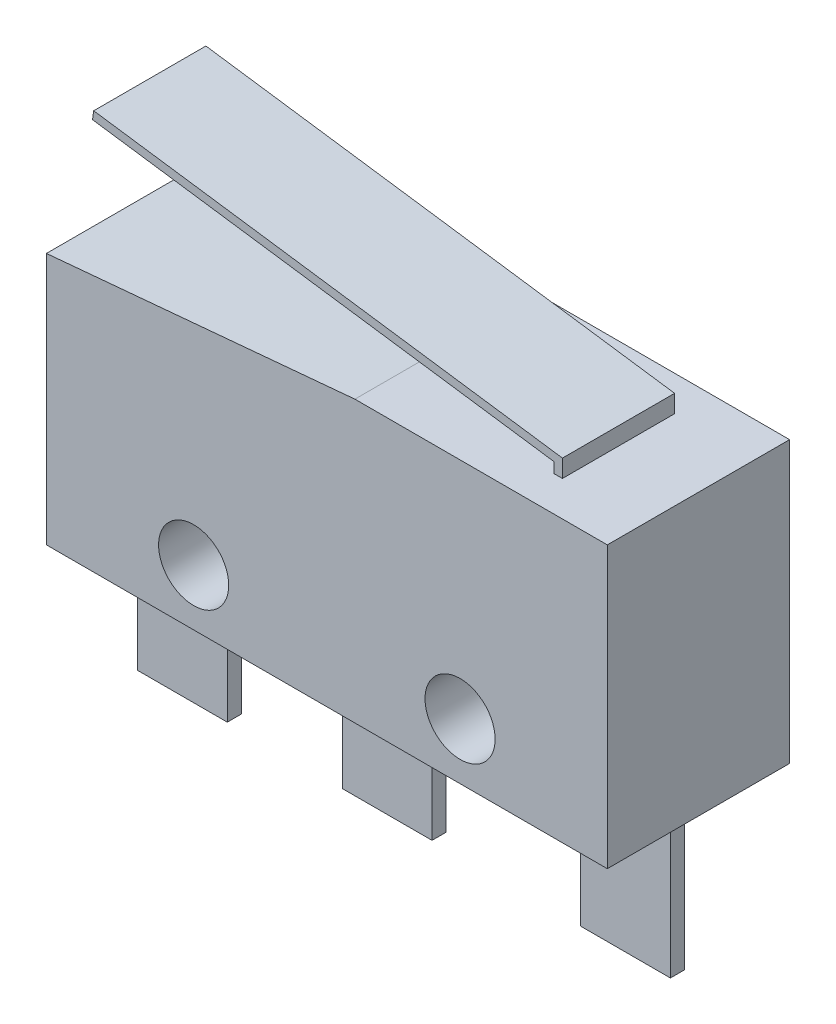
ISO-10303-21;
HEADER;
FILE_DESCRIPTION(('STEP AP214'),'2;1');
FILE_NAME('part.step','',(''),(''),'','','');
FILE_SCHEMA(('AUTOMOTIVE_DESIGN { 1 0 10303 214 1 1 1 1 }'));
ENDSEC;
DATA;
#1=APPLICATION_CONTEXT('core data for automotive mechanical design processes');
#2=APPLICATION_PROTOCOL_DEFINITION('international standard','automotive_design',2000,#1);
#3=PRODUCT_CONTEXT('',#1,'mechanical');
#4=PRODUCT('Part','Part','',(#3));
#5=PRODUCT_RELATED_PRODUCT_CATEGORY('part','',(#4));
#6=PRODUCT_DEFINITION_FORMATION('','',#4);
#7=PRODUCT_DEFINITION_CONTEXT('part definition',#1,'design');
#8=PRODUCT_DEFINITION('design','',#6,#7);
#9=PRODUCT_DEFINITION_SHAPE('','',#8);
#10=(LENGTH_UNIT() NAMED_UNIT(*) SI_UNIT(.MILLI.,.METRE.));
#11=(NAMED_UNIT(*) PLANE_ANGLE_UNIT() SI_UNIT($,.RADIAN.));
#12=(NAMED_UNIT(*) SI_UNIT($,.STERADIAN.) SOLID_ANGLE_UNIT());
#13=UNCERTAINTY_MEASURE_WITH_UNIT(LENGTH_MEASURE(1.E-05),#10,'distance_accuracy_value','');
#14=(GEOMETRIC_REPRESENTATION_CONTEXT(3) GLOBAL_UNCERTAINTY_ASSIGNED_CONTEXT((#13)) GLOBAL_UNIT_ASSIGNED_CONTEXT((#10,
#11,#12)) REPRESENTATION_CONTEXT('',''));
#15=CARTESIAN_POINT('',(0.,0.,0.));
#16=DIRECTION('',(0.,0.,1.));
#17=DIRECTION('',(1.,0.,0.));
#18=AXIS2_PLACEMENT_3D('',#15,#16,#17);
#19=CARTESIAN_POINT('',(-10.,10.,3.25));
#20=DIRECTION('',(0.,-1.,0.));
#21=DIRECTION('',(0.,0.,-1.));
#22=AXIS2_PLACEMENT_3D('',#19,#20,#21);
#23=PLANE('',#22);
#24=DIRECTION('',(1.,0.,0.));
#25=VECTOR('',#24,1.);
#26=CARTESIAN_POINT('',(2.00000000000001,10.,1.));
#27=LINE('',#26,#25);
#28=CARTESIAN_POINT('',(2.00000000000001,10.,1.));
#29=VERTEX_POINT('',#28);
#30=CARTESIAN_POINT('',(4.00000000000001,10.,1.));
#31=VERTEX_POINT('',#30);
#32=EDGE_CURVE('E400',#29,#31,#27,.T.);
#33=ORIENTED_EDGE('',*,*,#32,.F.);
#34=DIRECTION('',(0.,0.,-1.));
#35=VECTOR('',#34,1.);
#36=CARTESIAN_POINT('',(2.00000000000001,10.,1.));
#37=LINE('',#36,#35);
#38=CARTESIAN_POINT('',(2.00000000000001,10.,-1.));
#39=VERTEX_POINT('',#38);
#40=EDGE_CURVE('E420',#29,#39,#37,.T.);
#41=ORIENTED_EDGE('',*,*,#40,.T.);
#42=DIRECTION('',(1.,0.,0.));
#43=VECTOR('',#42,1.);
#44=CARTESIAN_POINT('',(2.00000000000001,10.,-1.));
#45=LINE('',#44,#43);
#46=CARTESIAN_POINT('',(4.00000000000001,10.,-1.));
#47=VERTEX_POINT('',#46);
#48=EDGE_CURVE('E408',#39,#47,#45,.T.);
#49=ORIENTED_EDGE('',*,*,#48,.T.);
#50=DIRECTION('',(0.,0.,-1.));
#51=VECTOR('',#50,1.);
#52=CARTESIAN_POINT('',(4.00000000000001,10.,1.));
#53=LINE('',#52,#51);
#54=EDGE_CURVE('E417',#31,#47,#53,.T.);
#55=ORIENTED_EDGE('',*,*,#54,.F.);
#56=EDGE_LOOP('',(#33,#41,#49,#55));
#57=FACE_BOUND('',#56,.T.);
#58=DIRECTION('',(-1.,0.,0.));
#59=VECTOR('',#58,1.);
#60=CARTESIAN_POINT('',(-10.,10.,-3.25));
#61=LINE('',#60,#59);
#62=CARTESIAN_POINT('',(10.,10.,-3.25));
#63=VERTEX_POINT('',#62);
#64=CARTESIAN_POINT('',(1.00000000000002,10.,-3.25));
#65=VERTEX_POINT('',#64);
#66=EDGE_CURVE('E437',#63,#65,#61,.T.);
#67=ORIENTED_EDGE('',*,*,#66,.T.);
#68=DIRECTION('',(0.,0.,1.));
#69=VECTOR('',#68,1.);
#70=CARTESIAN_POINT('',(1.00000000000001,10.,-3.25));
#71=LINE('',#70,#69);
#72=CARTESIAN_POINT('',(1.00000000000001,10.,3.25));
#73=VERTEX_POINT('',#72);
#74=EDGE_CURVE('E429',#65,#73,#71,.T.);
#75=ORIENTED_EDGE('',*,*,#74,.T.);
#76=DIRECTION('',(-1.,0.,0.));
#77=VECTOR('',#76,1.);
#78=CARTESIAN_POINT('',(-10.,10.,3.25));
#79=LINE('',#78,#77);
#80=CARTESIAN_POINT('',(10.,10.,3.25));
#81=VERTEX_POINT('',#80);
#82=EDGE_CURVE('E441',#81,#73,#79,.T.);
#83=ORIENTED_EDGE('',*,*,#82,.F.);
#84=DIRECTION('',(0.,0.,-1.));
#85=VECTOR('',#84,1.);
#86=CARTESIAN_POINT('',(10.,10.,3.25));
#87=LINE('',#86,#85);
#88=EDGE_CURVE('E444',#81,#63,#87,.T.);
#89=ORIENTED_EDGE('',*,*,#88,.T.);
#90=EDGE_LOOP('',(#67,#75,#83,#89));
#91=FACE_BOUND('',#90,.T.);
#92=DIRECTION('',(-1.,0.,0.));
#93=VECTOR('',#92,1.);
#94=CARTESIAN_POINT('',(7.15000000000001,10.,2.));
#95=LINE('',#94,#93);
#96=CARTESIAN_POINT('',(7.15000000000001,10.,2.));
#97=VERTEX_POINT('',#96);
#98=CARTESIAN_POINT('',(6.85000000000001,10.,2.));
#99=VERTEX_POINT('',#98);
#100=EDGE_CURVE('E255',#97,#99,#95,.T.);
#101=ORIENTED_EDGE('',*,*,#100,.T.);
#102=DIRECTION('',(0.,0.,-1.));
#103=VECTOR('',#102,1.);
#104=CARTESIAN_POINT('',(6.85000000000001,10.,2.));
#105=LINE('',#104,#103);
#106=CARTESIAN_POINT('',(6.85000000000001,10.,-2.));
#107=VERTEX_POINT('',#106);
#108=EDGE_CURVE('E275',#99,#107,#105,.T.);
#109=ORIENTED_EDGE('',*,*,#108,.T.);
#110=DIRECTION('',(-1.,0.,0.));
#111=VECTOR('',#110,1.);
#112=CARTESIAN_POINT('',(7.15000000000001,10.,-2.));
#113=LINE('',#112,#111);
#114=CARTESIAN_POINT('',(7.15000000000001,10.,-2.));
#115=VERTEX_POINT('',#114);
#116=EDGE_CURVE('E269',#115,#107,#113,.T.);
#117=ORIENTED_EDGE('',*,*,#116,.F.);
#118=DIRECTION('',(0.,0.,-1.));
#119=VECTOR('',#118,1.);
#120=CARTESIAN_POINT('',(7.15000000000001,10.,2.));
#121=LINE('',#120,#119);
#122=EDGE_CURVE('E273',#97,#115,#121,.T.);
#123=ORIENTED_EDGE('',*,*,#122,.F.);
#124=EDGE_LOOP('',(#101,#109,#117,#123));
#125=FACE_BOUND('',#124,.T.);
#126=ADVANCED_FACE('F32',(#57,#91,#125),#23,.F.);
#127=CARTESIAN_POINT('',(3.00000000000001,9.96666666666667,1.));
#128=DIRECTION('',(0.,0.,-1.));
#129=DIRECTION('',(-1.,0.,0.));
#130=AXIS2_PLACEMENT_3D('',#127,#128,#129);
#131=CYLINDRICAL_SURFACE('',#130,1.13333333333333);
#132=CARTESIAN_POINT('',(3.00000000000001,9.96666666666667,1.));
#133=DIRECTION('',(0.,0.,1.));
#134=DIRECTION('',(-1.,0.,0.));
#135=AXIS2_PLACEMENT_3D('',#132,#133,#134);
#136=CIRCLE('',#135,1.13333333333333);
#137=CARTESIAN_POINT('',(2.50381724234199,10.9856107845884,1.));
#138=VERTEX_POINT('',#137);
#139=CARTESIAN_POINT('',(2.00000000000001,10.5,1.));
#140=VERTEX_POINT('',#139);
#141=EDGE_CURVE('E394',#138,#140,#136,.T.);
#142=ORIENTED_EDGE('',*,*,#141,.F.);
#143=DIRECTION('',(0.,0.,-1.));
#144=VECTOR('',#143,1.);
#145=CARTESIAN_POINT('',(2.503817242342,10.9856107845884,1.));
#146=LINE('',#145,#144);
#147=CARTESIAN_POINT('',(2.50381724234199,10.9856107845884,-1.));
#148=VERTEX_POINT('',#147);
#149=EDGE_CURVE('E11',#138,#148,#146,.T.);
#150=ORIENTED_EDGE('',*,*,#149,.T.);
#151=CARTESIAN_POINT('',(3.00000000000001,9.96666666666667,-1.));
#152=DIRECTION('',(0.,0.,1.));
#153=DIRECTION('',(-1.,0.,0.));
#154=AXIS2_PLACEMENT_3D('',#151,#152,#153);
#155=CIRCLE('',#154,1.13333333333333);
#156=CARTESIAN_POINT('',(2.00000000000001,10.5,-1.));
#157=VERTEX_POINT('',#156);
#158=EDGE_CURVE('E387',#148,#157,#155,.T.);
#159=ORIENTED_EDGE('',*,*,#158,.T.);
#160=DIRECTION('',(0.,0.,-1.));
#161=VECTOR('',#160,1.);
#162=CARTESIAN_POINT('',(2.00000000000001,10.5,1.));
#163=LINE('',#162,#161);
#164=EDGE_CURVE('E405',#140,#157,#163,.T.);
#165=ORIENTED_EDGE('',*,*,#164,.F.);
#166=EDGE_LOOP('',(#142,#150,#159,#165));
#167=FACE_BOUND('',#166,.T.);
#168=ADVANCED_FACE('F479',(#167),#131,.T.);
#169=CARTESIAN_POINT('',(-10.,10.,3.25));
#170=DIRECTION('',(1.,0.,0.));
#171=DIRECTION('',(0.,1.,0.));
#172=AXIS2_PLACEMENT_3D('',#169,#170,#171);
#173=PLANE('',#172);
#174=DIRECTION('',(0.,-1.,0.));
#175=VECTOR('',#174,1.);
#176=CARTESIAN_POINT('',(-10.,10.,3.25));
#177=LINE('',#176,#175);
#178=CARTESIAN_POINT('',(-10.,9.,3.25));
#179=VERTEX_POINT('',#178);
#180=CARTESIAN_POINT('',(-10.,0.,3.25));
#181=VERTEX_POINT('',#180);
#182=EDGE_CURVE('E434',#179,#181,#177,.T.);
#183=ORIENTED_EDGE('',*,*,#182,.F.);
#184=DIRECTION('',(0.,0.,1.));
#185=VECTOR('',#184,1.);
#186=CARTESIAN_POINT('',(-10.,9.,-3.25));
#187=LINE('',#186,#185);
#188=CARTESIAN_POINT('',(-10.,9.,-3.25));
#189=VERTEX_POINT('',#188);
#190=EDGE_CURVE('E427',#189,#179,#187,.T.);
#191=ORIENTED_EDGE('',*,*,#190,.F.);
#192=DIRECTION('',(0.,-1.,0.));
#193=VECTOR('',#192,1.);
#194=CARTESIAN_POINT('',(-10.,10.,-3.25));
#195=LINE('',#194,#193);
#196=CARTESIAN_POINT('',(-10.,0.,-3.25));
#197=VERTEX_POINT('',#196);
#198=EDGE_CURVE('E432',#189,#197,#195,.T.);
#199=ORIENTED_EDGE('',*,*,#198,.T.);
#200=DIRECTION('',(0.,0.,-1.));
#201=VECTOR('',#200,1.);
#202=CARTESIAN_POINT('',(-10.,0.,3.25));
#203=LINE('',#202,#201);
#204=EDGE_CURVE('E457',#181,#197,#203,.T.);
#205=ORIENTED_EDGE('',*,*,#204,.F.);
#206=EDGE_LOOP('',(#183,#191,#199,#205));
#207=FACE_BOUND('',#206,.T.);
#208=ADVANCED_FACE('F34',(#207),#173,.F.);
#209=CARTESIAN_POINT('',(-10.,0.,3.25));
#210=DIRECTION('',(0.,1.,0.));
#211=DIRECTION('',(0.,0.,1.));
#212=AXIS2_PLACEMENT_3D('',#209,#210,#211);
#213=PLANE('',#212);
#214=DIRECTION('',(0.,0.,-1.));
#215=VECTOR('',#214,1.);
#216=CARTESIAN_POINT('',(-2.19999999999999,0.,0.5));
#217=LINE('',#216,#215);
#218=CARTESIAN_POINT('',(-2.19999999999999,0.,0.5));
#219=VERTEX_POINT('',#218);
#220=CARTESIAN_POINT('',(-2.19999999999999,0.,0.));
#221=VERTEX_POINT('',#220);
#222=EDGE_CURVE('E296',#219,#221,#217,.T.);
#223=ORIENTED_EDGE('',*,*,#222,.F.);
#224=DIRECTION('',(-1.,0.,0.));
#225=VECTOR('',#224,1.);
#226=CARTESIAN_POINT('',(-2.19999999999999,0.,0.5));
#227=LINE('',#226,#225);
#228=CARTESIAN_POINT('',(1.00000000000001,0.,0.5));
#229=VERTEX_POINT('',#228);
#230=EDGE_CURVE('E293',#229,#219,#227,.T.);
#231=ORIENTED_EDGE('',*,*,#230,.F.);
#232=DIRECTION('',(0.,0.,-1.));
#233=VECTOR('',#232,1.);
#234=CARTESIAN_POINT('',(1.00000000000001,0.,0.5));
#235=LINE('',#234,#233);
#236=CARTESIAN_POINT('',(1.00000000000001,0.,0.));
#237=VERTEX_POINT('',#236);
#238=EDGE_CURVE('E307',#229,#237,#235,.T.);
#239=ORIENTED_EDGE('',*,*,#238,.T.);
#240=DIRECTION('',(-1.,0.,0.));
#241=VECTOR('',#240,1.);
#242=CARTESIAN_POINT('',(-2.19999999999999,0.,0.));
#243=LINE('',#242,#241);
#244=EDGE_CURVE('E288',#237,#221,#243,.T.);
#245=ORIENTED_EDGE('',*,*,#244,.T.);
#246=EDGE_LOOP('',(#223,#231,#239,#245));
#247=FACE_BOUND('',#246,.T.);
#248=DIRECTION('',(0.,0.,-1.));
#249=VECTOR('',#248,1.);
#250=CARTESIAN_POINT('',(6.3,0.,0.5));
#251=LINE('',#250,#249);
#252=CARTESIAN_POINT('',(6.3,0.,0.5));
#253=VERTEX_POINT('',#252);
#254=CARTESIAN_POINT('',(6.30000000000001,0.,0.));
#255=VERTEX_POINT('',#254);
#256=EDGE_CURVE('E342',#253,#255,#251,.T.);
#257=ORIENTED_EDGE('',*,*,#256,.F.);
#258=DIRECTION('',(-1.,0.,0.));
#259=VECTOR('',#258,1.);
#260=CARTESIAN_POINT('',(9.5,0.,0.5));
#261=LINE('',#260,#259);
#262=CARTESIAN_POINT('',(9.5,0.,0.5));
#263=VERTEX_POINT('',#262);
#264=EDGE_CURVE('E316',#263,#253,#261,.T.);
#265=ORIENTED_EDGE('',*,*,#264,.F.);
#266=DIRECTION('',(0.,0.,-1.));
#267=VECTOR('',#266,1.);
#268=CARTESIAN_POINT('',(9.5,0.,0.5));
#269=LINE('',#268,#267);
#270=CARTESIAN_POINT('',(9.5,0.,0.));
#271=VERTEX_POINT('',#270);
#272=EDGE_CURVE('E327',#263,#271,#269,.T.);
#273=ORIENTED_EDGE('',*,*,#272,.T.);
#274=DIRECTION('',(-1.,0.,0.));
#275=VECTOR('',#274,1.);
#276=CARTESIAN_POINT('',(9.5,0.,0.));
#277=LINE('',#276,#275);
#278=EDGE_CURVE('E315',#271,#255,#277,.T.);
#279=ORIENTED_EDGE('',*,*,#278,.T.);
#280=EDGE_LOOP('',(#257,#265,#273,#279));
#281=FACE_BOUND('',#280,.T.);
#282=DIRECTION('',(0.,0.,-1.));
#283=VECTOR('',#282,1.);
#284=CARTESIAN_POINT('',(-9.5,0.,0.5));
#285=LINE('',#284,#283);
#286=CARTESIAN_POINT('',(-9.5,0.,0.5));
#287=VERTEX_POINT('',#286);
#288=CARTESIAN_POINT('',(-9.5,0.,0.));
#289=VERTEX_POINT('',#288);
#290=EDGE_CURVE('E358',#287,#289,#285,.T.);
#291=ORIENTED_EDGE('',*,*,#290,.F.);
#292=DIRECTION('',(-1.,0.,0.));
#293=VECTOR('',#292,1.);
#294=CARTESIAN_POINT('',(-9.5,0.,0.5));
#295=LINE('',#294,#293);
#296=CARTESIAN_POINT('',(-6.3,0.,0.5));
#297=VERTEX_POINT('',#296);
#298=EDGE_CURVE('E355',#297,#287,#295,.T.);
#299=ORIENTED_EDGE('',*,*,#298,.F.);
#300=DIRECTION('',(0.,0.,-1.));
#301=VECTOR('',#300,1.);
#302=CARTESIAN_POINT('',(-6.3,0.,0.5));
#303=LINE('',#302,#301);
#304=CARTESIAN_POINT('',(-6.3,0.,0.));
#305=VERTEX_POINT('',#304);
#306=EDGE_CURVE('E369',#297,#305,#303,.T.);
#307=ORIENTED_EDGE('',*,*,#306,.T.);
#308=DIRECTION('',(-1.,0.,0.));
#309=VECTOR('',#308,1.);
#310=CARTESIAN_POINT('',(-9.5,0.,0.));
#311=LINE('',#310,#309);
#312=EDGE_CURVE('E350',#305,#289,#311,.T.);
#313=ORIENTED_EDGE('',*,*,#312,.T.);
#314=EDGE_LOOP('',(#291,#299,#307,#313));
#315=FACE_BOUND('',#314,.T.);
#316=DIRECTION('',(1.,0.,0.));
#317=VECTOR('',#316,1.);
#318=CARTESIAN_POINT('',(-10.,0.,-3.25));
#319=LINE('',#318,#317);
#320=CARTESIAN_POINT('',(10.,0.,-3.25));
#321=VERTEX_POINT('',#320);
#322=EDGE_CURVE('E446',#197,#321,#319,.T.);
#323=ORIENTED_EDGE('',*,*,#322,.T.);
#324=DIRECTION('',(0.,0.,-1.));
#325=VECTOR('',#324,1.);
#326=CARTESIAN_POINT('',(10.,0.,3.25));
#327=LINE('',#326,#325);
#328=CARTESIAN_POINT('',(10.,0.,3.25));
#329=VERTEX_POINT('',#328);
#330=EDGE_CURVE('E454',#329,#321,#327,.T.);
#331=ORIENTED_EDGE('',*,*,#330,.F.);
#332=DIRECTION('',(1.,0.,0.));
#333=VECTOR('',#332,1.);
#334=CARTESIAN_POINT('',(-10.,0.,3.25));
#335=LINE('',#334,#333);
#336=EDGE_CURVE('E436',#181,#329,#335,.T.);
#337=ORIENTED_EDGE('',*,*,#336,.F.);
#338=ORIENTED_EDGE('',*,*,#204,.T.);
#339=EDGE_LOOP('',(#323,#331,#337,#338));
#340=FACE_BOUND('',#339,.T.);
#341=ADVANCED_FACE('F610',(#247,#281,#315,#340),#213,.F.);
#342=CARTESIAN_POINT('',(10.,10.,3.25));
#343=DIRECTION('',(-1.,0.,0.));
#344=DIRECTION('',(0.,-1.,0.));
#345=AXIS2_PLACEMENT_3D('',#342,#343,#344);
#346=PLANE('',#345);
#347=DIRECTION('',(0.,1.,0.));
#348=VECTOR('',#347,1.);
#349=CARTESIAN_POINT('',(10.,10.,-3.25));
#350=LINE('',#349,#348);
#351=EDGE_CURVE('E448',#321,#63,#350,.T.);
#352=ORIENTED_EDGE('',*,*,#351,.T.);
#353=ORIENTED_EDGE('',*,*,#88,.F.);
#354=DIRECTION('',(0.,1.,0.));
#355=VECTOR('',#354,1.);
#356=CARTESIAN_POINT('',(10.,10.,3.25));
#357=LINE('',#356,#355);
#358=EDGE_CURVE('E439',#329,#81,#357,.T.);
#359=ORIENTED_EDGE('',*,*,#358,.F.);
#360=ORIENTED_EDGE('',*,*,#330,.T.);
#361=EDGE_LOOP('',(#352,#353,#359,#360));
#362=FACE_BOUND('',#361,.T.);
#363=ADVANCED_FACE('F604',(#362),#346,.F.);
#364=CARTESIAN_POINT('',(-10.,0.,3.25));
#365=DIRECTION('',(0.,0.,1.));
#366=DIRECTION('',(1.,0.,0.));
#367=AXIS2_PLACEMENT_3D('',#364,#365,#366);
#368=PLANE('',#367);
#369=CARTESIAN_POINT('',(4.75,2.,3.25));
#370=DIRECTION('',(0.,0.,1.));
#371=DIRECTION('',(1.,0.,0.));
#372=AXIS2_PLACEMENT_3D('',#369,#370,#371);
#373=CIRCLE('',#372,1.25);
#374=CARTESIAN_POINT('',(6.,2.,3.25));
#375=VERTEX_POINT('',#374);
#376=EDGE_CURVE('E377',#375,#375,#373,.T.);
#377=ORIENTED_EDGE('',*,*,#376,.F.);
#378=EDGE_LOOP('',(#377));
#379=FACE_BOUND('',#378,.T.);
#380=CARTESIAN_POINT('',(-4.75,2.,3.25));
#381=DIRECTION('',(0.,0.,1.));
#382=DIRECTION('',(1.,0.,0.));
#383=AXIS2_PLACEMENT_3D('',#380,#381,#382);
#384=CIRCLE('',#383,1.25);
#385=CARTESIAN_POINT('',(-3.5,2.,3.25));
#386=VERTEX_POINT('',#385);
#387=EDGE_CURVE('E381',#386,#386,#384,.T.);
#388=ORIENTED_EDGE('',*,*,#387,.F.);
#389=EDGE_LOOP('',(#388));
#390=FACE_BOUND('',#389,.T.);
#391=DIRECTION('',(0.995893206467704,0.0905357460425185,0.));
#392=VECTOR('',#391,1.);
#393=CARTESIAN_POINT('',(1.00000000000001,10.,3.25));
#394=LINE('',#393,#392);
#395=EDGE_CURVE('E423',#179,#73,#394,.T.);
#396=ORIENTED_EDGE('',*,*,#395,.F.);
#397=ORIENTED_EDGE('',*,*,#182,.T.);
#398=ORIENTED_EDGE('',*,*,#336,.T.);
#399=ORIENTED_EDGE('',*,*,#358,.T.);
#400=ORIENTED_EDGE('',*,*,#82,.T.);
#401=EDGE_LOOP('',(#396,#397,#398,#399,#400));
#402=FACE_BOUND('',#401,.T.);
#403=ADVANCED_FACE('F601',(#379,#390,#402),#368,.T.);
#404=CARTESIAN_POINT('',(-10.,0.,-3.25));
#405=DIRECTION('',(0.,0.,1.));
#406=DIRECTION('',(1.,0.,0.));
#407=AXIS2_PLACEMENT_3D('',#404,#405,#406);
#408=PLANE('',#407);
#409=CARTESIAN_POINT('',(4.75,2.,-3.25));
#410=DIRECTION('',(0.,0.,1.));
#411=DIRECTION('',(1.,0.,0.));
#412=AXIS2_PLACEMENT_3D('',#409,#410,#411);
#413=CIRCLE('',#412,1.25);
#414=CARTESIAN_POINT('',(6.,2.,-3.25));
#415=VERTEX_POINT('',#414);
#416=EDGE_CURVE('E378',#415,#415,#413,.T.);
#417=ORIENTED_EDGE('',*,*,#416,.T.);
#418=EDGE_LOOP('',(#417));
#419=FACE_BOUND('',#418,.T.);
#420=CARTESIAN_POINT('',(-4.75,2.,-3.25));
#421=DIRECTION('',(0.,0.,1.));
#422=DIRECTION('',(1.,0.,0.));
#423=AXIS2_PLACEMENT_3D('',#420,#421,#422);
#424=CIRCLE('',#423,1.25);
#425=CARTESIAN_POINT('',(-3.5,2.,-3.25));
#426=VERTEX_POINT('',#425);
#427=EDGE_CURVE('E384',#426,#426,#424,.T.);
#428=ORIENTED_EDGE('',*,*,#427,.T.);
#429=EDGE_LOOP('',(#428));
#430=FACE_BOUND('',#429,.T.);
#431=ORIENTED_EDGE('',*,*,#198,.F.);
#432=DIRECTION('',(0.995893206467704,0.0905357460425185,0.));
#433=VECTOR('',#432,1.);
#434=CARTESIAN_POINT('',(1.00000000000001,10.,-3.25));
#435=LINE('',#434,#433);
#436=EDGE_CURVE('E424',#189,#65,#435,.T.);
#437=ORIENTED_EDGE('',*,*,#436,.T.);
#438=ORIENTED_EDGE('',*,*,#66,.F.);
#439=ORIENTED_EDGE('',*,*,#351,.F.);
#440=ORIENTED_EDGE('',*,*,#322,.F.);
#441=EDGE_LOOP('',(#431,#437,#438,#439,#440));
#442=FACE_BOUND('',#441,.T.);
#443=ADVANCED_FACE('F599',(#419,#430,#442),#408,.F.);
#444=CARTESIAN_POINT('',(1.00000000000001,10.,-3.25));
#445=DIRECTION('',(0.0905357460425185,-0.995893206467704,0.));
#446=DIRECTION('',(0.995893206467704,0.0905357460425185,0.));
#447=AXIS2_PLACEMENT_3D('',#444,#445,#446);
#448=PLANE('',#447);
#449=ORIENTED_EDGE('',*,*,#395,.T.);
#450=ORIENTED_EDGE('',*,*,#74,.F.);
#451=ORIENTED_EDGE('',*,*,#436,.F.);
#452=ORIENTED_EDGE('',*,*,#190,.T.);
#453=EDGE_LOOP('',(#449,#450,#451,#452));
#454=FACE_BOUND('',#453,.T.);
#455=ADVANCED_FACE('F596',(#454),#448,.F.);
#456=CARTESIAN_POINT('',(2.00000000000001,10.,1.));
#457=DIRECTION('',(1.,0.,0.));
#458=DIRECTION('',(0.,0.,-1.));
#459=AXIS2_PLACEMENT_3D('',#456,#457,#458);
#460=PLANE('',#459);
#461=DIRECTION('',(0.,-1.,0.));
#462=VECTOR('',#461,1.);
#463=CARTESIAN_POINT('',(2.00000000000001,10.,-1.));
#464=LINE('',#463,#462);
#465=EDGE_CURVE('E393',#157,#39,#464,.T.);
#466=ORIENTED_EDGE('',*,*,#465,.T.);
#467=ORIENTED_EDGE('',*,*,#40,.F.);
#468=DIRECTION('',(0.,-1.,0.));
#469=VECTOR('',#468,1.);
#470=CARTESIAN_POINT('',(2.00000000000001,10.,1.));
#471=LINE('',#470,#469);
#472=EDGE_CURVE('E398',#140,#29,#471,.T.);
#473=ORIENTED_EDGE('',*,*,#472,.F.);
#474=ORIENTED_EDGE('',*,*,#164,.T.);
#475=EDGE_LOOP('',(#466,#467,#473,#474));
#476=FACE_BOUND('',#475,.T.);
#477=ADVANCED_FACE('F484',(#476),#460,.F.);
#478=CARTESIAN_POINT('',(4.00000000000001,10.,1.));
#479=DIRECTION('',(-1.,0.,0.));
#480=DIRECTION('',(0.,0.,1.));
#481=AXIS2_PLACEMENT_3D('',#478,#479,#480);
#482=PLANE('',#481);
#483=DIRECTION('',(0.,1.,0.));
#484=VECTOR('',#483,1.);
#485=CARTESIAN_POINT('',(4.00000000000001,10.,-1.));
#486=LINE('',#485,#484);
#487=CARTESIAN_POINT('',(4.00000000000001,10.5,-1.));
#488=VERTEX_POINT('',#487);
#489=EDGE_CURVE('E401',#47,#488,#486,.T.);
#490=ORIENTED_EDGE('',*,*,#489,.T.);
#491=DIRECTION('',(0.,0.,-1.));
#492=VECTOR('',#491,1.);
#493=CARTESIAN_POINT('',(4.00000000000001,10.5,1.));
#494=LINE('',#493,#492);
#495=CARTESIAN_POINT('',(4.00000000000001,10.5,1.));
#496=VERTEX_POINT('',#495);
#497=EDGE_CURVE('E414',#496,#488,#494,.T.);
#498=ORIENTED_EDGE('',*,*,#497,.F.);
#499=DIRECTION('',(0.,1.,0.));
#500=VECTOR('',#499,1.);
#501=CARTESIAN_POINT('',(4.00000000000001,10.,1.));
#502=LINE('',#501,#500);
#503=EDGE_CURVE('E403',#31,#496,#502,.T.);
#504=ORIENTED_EDGE('',*,*,#503,.F.);
#505=ORIENTED_EDGE('',*,*,#54,.T.);
#506=EDGE_LOOP('',(#490,#498,#504,#505));
#507=FACE_BOUND('',#506,.T.);
#508=ADVANCED_FACE('F472',(#507),#482,.F.);
#509=CARTESIAN_POINT('',(2.00000000000001,10.5,1.));
#510=DIRECTION('',(0.,0.,-1.));
#511=DIRECTION('',(-1.,0.,0.));
#512=AXIS2_PLACEMENT_3D('',#509,#510,#511);
#513=PLANE('',#512);
#514=CARTESIAN_POINT('',(3.75973414846379,10.8076473252448,1.));
#515=VERTEX_POINT('',#514);
#516=EDGE_CURVE('E390',#496,#515,#136,.T.);
#517=ORIENTED_EDGE('',*,*,#516,.T.);
#518=DIRECTION('',(-0.990109250943421,0.140298507462686,0.));
#519=VECTOR('',#518,1.);
#520=CARTESIAN_POINT('',(2.07737357986189,11.0460378630203,1.));
#521=LINE('',#520,#519);
#522=EDGE_CURVE('E55',#515,#138,#521,.T.);
#523=ORIENTED_EDGE('',*,*,#522,.T.);
#524=ORIENTED_EDGE('',*,*,#141,.T.);
#525=ORIENTED_EDGE('',*,*,#472,.T.);
#526=ORIENTED_EDGE('',*,*,#32,.T.);
#527=ORIENTED_EDGE('',*,*,#503,.T.);
#528=EDGE_LOOP('',(#517,#523,#524,#525,#526,#527));
#529=FACE_BOUND('',#528,.T.);
#530=ADVANCED_FACE('F465',(#529),#513,.F.);
#531=CARTESIAN_POINT('',(2.00000000000001,10.5,-1.));
#532=DIRECTION('',(0.,0.,-1.));
#533=DIRECTION('',(-1.,0.,0.));
#534=AXIS2_PLACEMENT_3D('',#531,#532,#533);
#535=PLANE('',#534);
#536=DIRECTION('',(-0.990109250943421,0.140298507462686,0.));
#537=VECTOR('',#536,1.);
#538=CARTESIAN_POINT('',(2.07737357986189,11.0460378630203,-1.));
#539=LINE('',#538,#537);
#540=CARTESIAN_POINT('',(3.75973414846379,10.8076473252448,-1.));
#541=VERTEX_POINT('',#540);
#542=EDGE_CURVE('E244',#541,#148,#539,.T.);
#543=ORIENTED_EDGE('',*,*,#542,.F.);
#544=EDGE_CURVE('E395',#488,#541,#155,.T.);
#545=ORIENTED_EDGE('',*,*,#544,.F.);
#546=ORIENTED_EDGE('',*,*,#489,.F.);
#547=ORIENTED_EDGE('',*,*,#48,.F.);
#548=ORIENTED_EDGE('',*,*,#465,.F.);
#549=ORIENTED_EDGE('',*,*,#158,.F.);
#550=EDGE_LOOP('',(#543,#545,#546,#547,#548,#549));
#551=FACE_BOUND('',#550,.T.);
#552=ADVANCED_FACE('F474',(#551),#535,.T.);
#553=ORIENTED_EDGE('',*,*,#544,.T.);
#554=DIRECTION('',(0.,0.,-1.));
#555=VECTOR('',#554,1.);
#556=CARTESIAN_POINT('',(3.75973414846379,10.8076473252448,1.));
#557=LINE('',#556,#555);
#558=EDGE_CURVE('E40',#541,#515,#557,.F.);
#559=ORIENTED_EDGE('',*,*,#558,.T.);
#560=ORIENTED_EDGE('',*,*,#516,.F.);
#561=ORIENTED_EDGE('',*,*,#497,.T.);
#562=EDGE_LOOP('',(#553,#559,#560,#561));
#563=FACE_BOUND('',#562,.T.);
#564=ADVANCED_FACE('F461',(#563),#131,.T.);
#565=CARTESIAN_POINT('',(-4.75,2.,-3.25));
#566=DIRECTION('',(0.,0.,1.));
#567=DIRECTION('',(1.,0.,0.));
#568=AXIS2_PLACEMENT_3D('',#565,#566,#567);
#569=CYLINDRICAL_SURFACE('',#568,1.25);
#570=ORIENTED_EDGE('',*,*,#427,.F.);
#571=EDGE_LOOP('',(#570));
#572=FACE_BOUND('',#571,.T.);
#573=ORIENTED_EDGE('',*,*,#387,.T.);
#574=EDGE_LOOP('',(#573));
#575=FACE_BOUND('',#574,.T.);
#576=ADVANCED_FACE('F581',(#572,#575),#569,.F.);
#577=CARTESIAN_POINT('',(4.75,2.,-3.25));
#578=DIRECTION('',(0.,0.,1.));
#579=DIRECTION('',(1.,0.,0.));
#580=AXIS2_PLACEMENT_3D('',#577,#578,#579);
#581=CYLINDRICAL_SURFACE('',#580,1.25);
#582=ORIENTED_EDGE('',*,*,#416,.F.);
#583=EDGE_LOOP('',(#582));
#584=FACE_BOUND('',#583,.T.);
#585=ORIENTED_EDGE('',*,*,#376,.T.);
#586=EDGE_LOOP('',(#585));
#587=FACE_BOUND('',#586,.T.);
#588=ADVANCED_FACE('F577',(#584,#587),#581,.F.);
#589=CARTESIAN_POINT('',(-9.5,0.,0.5));
#590=DIRECTION('',(1.,0.,0.));
#591=DIRECTION('',(0.,1.,0.));
#592=AXIS2_PLACEMENT_3D('',#589,#590,#591);
#593=PLANE('',#592);
#594=DIRECTION('',(0.,-1.,0.));
#595=VECTOR('',#594,1.);
#596=CARTESIAN_POINT('',(-9.5,0.,0.));
#597=LINE('',#596,#595);
#598=CARTESIAN_POINT('',(-9.5,-5.,0.));
#599=VERTEX_POINT('',#598);
#600=EDGE_CURVE('E345',#289,#599,#597,.T.);
#601=ORIENTED_EDGE('',*,*,#600,.T.);
#602=DIRECTION('',(0.,0.,-1.));
#603=VECTOR('',#602,1.);
#604=CARTESIAN_POINT('',(-9.5,-5.,0.5));
#605=LINE('',#604,#603);
#606=CARTESIAN_POINT('',(-9.5,-5.,0.5));
#607=VERTEX_POINT('',#606);
#608=EDGE_CURVE('E374',#607,#599,#605,.T.);
#609=ORIENTED_EDGE('',*,*,#608,.F.);
#610=DIRECTION('',(0.,-1.,0.));
#611=VECTOR('',#610,1.);
#612=CARTESIAN_POINT('',(-9.5,0.,0.5));
#613=LINE('',#612,#611);
#614=EDGE_CURVE('E346',#287,#607,#613,.T.);
#615=ORIENTED_EDGE('',*,*,#614,.F.);
#616=ORIENTED_EDGE('',*,*,#290,.T.);
#617=EDGE_LOOP('',(#601,#609,#615,#616));
#618=FACE_BOUND('',#617,.T.);
#619=ADVANCED_FACE('F573',(#618),#593,.F.);
#620=CARTESIAN_POINT('',(-9.5,-5.,0.5));
#621=DIRECTION('',(0.,1.,0.));
#622=DIRECTION('',(0.,0.,1.));
#623=AXIS2_PLACEMENT_3D('',#620,#621,#622);
#624=PLANE('',#623);
#625=DIRECTION('',(1.,0.,0.));
#626=VECTOR('',#625,1.);
#627=CARTESIAN_POINT('',(-9.5,-5.,0.));
#628=LINE('',#627,#626);
#629=CARTESIAN_POINT('',(-6.3,-5.,0.));
#630=VERTEX_POINT('',#629);
#631=EDGE_CURVE('E361',#599,#630,#628,.T.);
#632=ORIENTED_EDGE('',*,*,#631,.T.);
#633=DIRECTION('',(0.,0.,-1.));
#634=VECTOR('',#633,1.);
#635=CARTESIAN_POINT('',(-6.3,-5.,0.5));
#636=LINE('',#635,#634);
#637=CARTESIAN_POINT('',(-6.3,-5.,0.5));
#638=VERTEX_POINT('',#637);
#639=EDGE_CURVE('E371',#638,#630,#636,.T.);
#640=ORIENTED_EDGE('',*,*,#639,.F.);
#641=DIRECTION('',(1.,0.,0.));
#642=VECTOR('',#641,1.);
#643=CARTESIAN_POINT('',(-9.5,-5.,0.5));
#644=LINE('',#643,#642);
#645=EDGE_CURVE('E349',#607,#638,#644,.T.);
#646=ORIENTED_EDGE('',*,*,#645,.F.);
#647=ORIENTED_EDGE('',*,*,#608,.T.);
#648=EDGE_LOOP('',(#632,#640,#646,#647));
#649=FACE_BOUND('',#648,.T.);
#650=ADVANCED_FACE('F569',(#649),#624,.F.);
#651=CARTESIAN_POINT('',(-6.3,0.,0.5));
#652=DIRECTION('',(-1.,0.,0.));
#653=DIRECTION('',(0.,0.,1.));
#654=AXIS2_PLACEMENT_3D('',#651,#652,#653);
#655=PLANE('',#654);
#656=DIRECTION('',(0.,1.,0.));
#657=VECTOR('',#656,1.);
#658=CARTESIAN_POINT('',(-6.3,0.,0.));
#659=LINE('',#658,#657);
#660=EDGE_CURVE('E363',#630,#305,#659,.T.);
#661=ORIENTED_EDGE('',*,*,#660,.T.);
#662=ORIENTED_EDGE('',*,*,#306,.F.);
#663=DIRECTION('',(0.,1.,0.));
#664=VECTOR('',#663,1.);
#665=CARTESIAN_POINT('',(-6.3,0.,0.5));
#666=LINE('',#665,#664);
#667=EDGE_CURVE('E352',#638,#297,#666,.T.);
#668=ORIENTED_EDGE('',*,*,#667,.F.);
#669=ORIENTED_EDGE('',*,*,#639,.T.);
#670=EDGE_LOOP('',(#661,#662,#668,#669));
#671=FACE_BOUND('',#670,.T.);
#672=ADVANCED_FACE('F562',(#671),#655,.F.);
#673=CARTESIAN_POINT('',(-9.5,-5.,0.5));
#674=DIRECTION('',(0.,0.,1.));
#675=DIRECTION('',(1.,0.,0.));
#676=AXIS2_PLACEMENT_3D('',#673,#674,#675);
#677=PLANE('',#676);
#678=ORIENTED_EDGE('',*,*,#614,.T.);
#679=ORIENTED_EDGE('',*,*,#645,.T.);
#680=ORIENTED_EDGE('',*,*,#667,.T.);
#681=ORIENTED_EDGE('',*,*,#298,.T.);
#682=EDGE_LOOP('',(#678,#679,#680,#681));
#683=FACE_BOUND('',#682,.T.);
#684=ADVANCED_FACE('F559',(#683),#677,.T.);
#685=CARTESIAN_POINT('',(-9.5,-5.,0.));
#686=DIRECTION('',(0.,0.,1.));
#687=DIRECTION('',(1.,0.,0.));
#688=AXIS2_PLACEMENT_3D('',#685,#686,#687);
#689=PLANE('',#688);
#690=ORIENTED_EDGE('',*,*,#600,.F.);
#691=ORIENTED_EDGE('',*,*,#312,.F.);
#692=ORIENTED_EDGE('',*,*,#660,.F.);
#693=ORIENTED_EDGE('',*,*,#631,.F.);
#694=EDGE_LOOP('',(#690,#691,#692,#693));
#695=FACE_BOUND('',#694,.T.);
#696=ADVANCED_FACE('F557',(#695),#689,.F.);
#697=CARTESIAN_POINT('',(6.3,0.,0.5));
#698=DIRECTION('',(1.,0.,0.));
#699=DIRECTION('',(0.,0.,-1.));
#700=AXIS2_PLACEMENT_3D('',#697,#698,#699);
#701=PLANE('',#700);
#702=DIRECTION('',(0.,-1.,0.));
#703=VECTOR('',#702,1.);
#704=CARTESIAN_POINT('',(6.3,0.,0.));
#705=LINE('',#704,#703);
#706=CARTESIAN_POINT('',(6.3,-5.,0.));
#707=VERTEX_POINT('',#706);
#708=EDGE_CURVE('E329',#255,#707,#705,.T.);
#709=ORIENTED_EDGE('',*,*,#708,.T.);
#710=DIRECTION('',(0.,0.,-1.));
#711=VECTOR('',#710,1.);
#712=CARTESIAN_POINT('',(6.3,-5.,0.5));
#713=LINE('',#712,#711);
#714=CARTESIAN_POINT('',(6.3,-5.,0.5));
#715=VERTEX_POINT('',#714);
#716=EDGE_CURVE('E339',#715,#707,#713,.T.);
#717=ORIENTED_EDGE('',*,*,#716,.F.);
#718=DIRECTION('',(0.,-1.,0.));
#719=VECTOR('',#718,1.);
#720=CARTESIAN_POINT('',(6.3,0.,0.5));
#721=LINE('',#720,#719);
#722=EDGE_CURVE('E319',#253,#715,#721,.T.);
#723=ORIENTED_EDGE('',*,*,#722,.F.);
#724=ORIENTED_EDGE('',*,*,#256,.T.);
#725=EDGE_LOOP('',(#709,#717,#723,#724));
#726=FACE_BOUND('',#725,.T.);
#727=ADVANCED_FACE('F553',(#726),#701,.F.);
#728=CARTESIAN_POINT('',(9.5,-5.,0.5));
#729=DIRECTION('',(0.,1.,0.));
#730=DIRECTION('',(0.,0.,1.));
#731=AXIS2_PLACEMENT_3D('',#728,#729,#730);
#732=PLANE('',#731);
#733=DIRECTION('',(1.,0.,0.));
#734=VECTOR('',#733,1.);
#735=CARTESIAN_POINT('',(9.5,-5.,0.));
#736=LINE('',#735,#734);
#737=CARTESIAN_POINT('',(9.5,-5.,0.));
#738=VERTEX_POINT('',#737);
#739=EDGE_CURVE('E331',#707,#738,#736,.T.);
#740=ORIENTED_EDGE('',*,*,#739,.T.);
#741=DIRECTION('',(0.,0.,-1.));
#742=VECTOR('',#741,1.);
#743=CARTESIAN_POINT('',(9.5,-5.,0.5));
#744=LINE('',#743,#742);
#745=CARTESIAN_POINT('',(9.5,-5.,0.5));
#746=VERTEX_POINT('',#745);
#747=EDGE_CURVE('E336',#746,#738,#744,.T.);
#748=ORIENTED_EDGE('',*,*,#747,.F.);
#749=DIRECTION('',(1.,0.,0.));
#750=VECTOR('',#749,1.);
#751=CARTESIAN_POINT('',(9.5,-5.,0.5));
#752=LINE('',#751,#750);
#753=EDGE_CURVE('E322',#715,#746,#752,.T.);
#754=ORIENTED_EDGE('',*,*,#753,.F.);
#755=ORIENTED_EDGE('',*,*,#716,.T.);
#756=EDGE_LOOP('',(#740,#748,#754,#755));
#757=FACE_BOUND('',#756,.T.);
#758=ADVANCED_FACE('F549',(#757),#732,.F.);
#759=CARTESIAN_POINT('',(9.5,0.,0.5));
#760=DIRECTION('',(-1.,0.,0.));
#761=DIRECTION('',(0.,-1.,0.));
#762=AXIS2_PLACEMENT_3D('',#759,#760,#761);
#763=PLANE('',#762);
#764=DIRECTION('',(0.,1.,0.));
#765=VECTOR('',#764,1.);
#766=CARTESIAN_POINT('',(9.5,0.,0.));
#767=LINE('',#766,#765);
#768=EDGE_CURVE('E320',#738,#271,#767,.T.);
#769=ORIENTED_EDGE('',*,*,#768,.T.);
#770=ORIENTED_EDGE('',*,*,#272,.F.);
#771=DIRECTION('',(0.,1.,0.));
#772=VECTOR('',#771,1.);
#773=CARTESIAN_POINT('',(9.5,0.,0.5));
#774=LINE('',#773,#772);
#775=EDGE_CURVE('E324',#746,#263,#774,.T.);
#776=ORIENTED_EDGE('',*,*,#775,.F.);
#777=ORIENTED_EDGE('',*,*,#747,.T.);
#778=EDGE_LOOP('',(#769,#770,#776,#777));
#779=FACE_BOUND('',#778,.T.);
#780=ADVANCED_FACE('F542',(#779),#763,.F.);
#781=CARTESIAN_POINT('',(6.3,0.,0.5));
#782=DIRECTION('',(0.,0.,1.));
#783=DIRECTION('',(1.,0.,0.));
#784=AXIS2_PLACEMENT_3D('',#781,#782,#783);
#785=PLANE('',#784);
#786=ORIENTED_EDGE('',*,*,#264,.T.);
#787=ORIENTED_EDGE('',*,*,#722,.T.);
#788=ORIENTED_EDGE('',*,*,#753,.T.);
#789=ORIENTED_EDGE('',*,*,#775,.T.);
#790=EDGE_LOOP('',(#786,#787,#788,#789));
#791=FACE_BOUND('',#790,.T.);
#792=ADVANCED_FACE('F539',(#791),#785,.T.);
#793=CARTESIAN_POINT('',(6.3,0.,0.));
#794=DIRECTION('',(0.,0.,1.));
#795=DIRECTION('',(1.,0.,0.));
#796=AXIS2_PLACEMENT_3D('',#793,#794,#795);
#797=PLANE('',#796);
#798=ORIENTED_EDGE('',*,*,#278,.F.);
#799=ORIENTED_EDGE('',*,*,#768,.F.);
#800=ORIENTED_EDGE('',*,*,#739,.F.);
#801=ORIENTED_EDGE('',*,*,#708,.F.);
#802=EDGE_LOOP('',(#798,#799,#800,#801));
#803=FACE_BOUND('',#802,.T.);
#804=ADVANCED_FACE('F537',(#803),#797,.F.);
#805=CARTESIAN_POINT('',(-2.19999999999999,0.,0.5));
#806=DIRECTION('',(1.,0.,0.));
#807=DIRECTION('',(0.,1.,0.));
#808=AXIS2_PLACEMENT_3D('',#805,#806,#807);
#809=PLANE('',#808);
#810=DIRECTION('',(0.,-1.,0.));
#811=VECTOR('',#810,1.);
#812=CARTESIAN_POINT('',(-2.19999999999999,0.,0.));
#813=LINE('',#812,#811);
#814=CARTESIAN_POINT('',(-2.19999999999999,-5.,0.));
#815=VERTEX_POINT('',#814);
#816=EDGE_CURVE('E283',#221,#815,#813,.T.);
#817=ORIENTED_EDGE('',*,*,#816,.T.);
#818=DIRECTION('',(0.,0.,-1.));
#819=VECTOR('',#818,1.);
#820=CARTESIAN_POINT('',(-2.19999999999999,-5.,0.5));
#821=LINE('',#820,#819);
#822=CARTESIAN_POINT('',(-2.19999999999999,-5.,0.5));
#823=VERTEX_POINT('',#822);
#824=EDGE_CURVE('E312',#823,#815,#821,.T.);
#825=ORIENTED_EDGE('',*,*,#824,.F.);
#826=DIRECTION('',(0.,-1.,0.));
#827=VECTOR('',#826,1.);
#828=CARTESIAN_POINT('',(-2.19999999999999,0.,0.5));
#829=LINE('',#828,#827);
#830=EDGE_CURVE('E284',#219,#823,#829,.T.);
#831=ORIENTED_EDGE('',*,*,#830,.F.);
#832=ORIENTED_EDGE('',*,*,#222,.T.);
#833=EDGE_LOOP('',(#817,#825,#831,#832));
#834=FACE_BOUND('',#833,.T.);
#835=ADVANCED_FACE('F533',(#834),#809,.F.);
#836=CARTESIAN_POINT('',(-2.19999999999999,-5.,0.5));
#837=DIRECTION('',(0.,1.,0.));
#838=DIRECTION('',(-1.,0.,0.));
#839=AXIS2_PLACEMENT_3D('',#836,#837,#838);
#840=PLANE('',#839);
#841=DIRECTION('',(1.,0.,0.));
#842=VECTOR('',#841,1.);
#843=CARTESIAN_POINT('',(-2.19999999999999,-5.,0.));
#844=LINE('',#843,#842);
#845=CARTESIAN_POINT('',(1.00000000000001,-5.,0.));
#846=VERTEX_POINT('',#845);
#847=EDGE_CURVE('E299',#815,#846,#844,.T.);
#848=ORIENTED_EDGE('',*,*,#847,.T.);
#849=DIRECTION('',(0.,0.,-1.));
#850=VECTOR('',#849,1.);
#851=CARTESIAN_POINT('',(1.00000000000001,-5.,0.5));
#852=LINE('',#851,#850);
#853=CARTESIAN_POINT('',(1.00000000000001,-5.,0.5));
#854=VERTEX_POINT('',#853);
#855=EDGE_CURVE('E309',#854,#846,#852,.T.);
#856=ORIENTED_EDGE('',*,*,#855,.F.);
#857=DIRECTION('',(1.,0.,0.));
#858=VECTOR('',#857,1.);
#859=CARTESIAN_POINT('',(-2.19999999999999,-5.,0.5));
#860=LINE('',#859,#858);
#861=EDGE_CURVE('E287',#823,#854,#860,.T.);
#862=ORIENTED_EDGE('',*,*,#861,.F.);
#863=ORIENTED_EDGE('',*,*,#824,.T.);
#864=EDGE_LOOP('',(#848,#856,#862,#863));
#865=FACE_BOUND('',#864,.T.);
#866=ADVANCED_FACE('F529',(#865),#840,.F.);
#867=CARTESIAN_POINT('',(1.00000000000001,0.,0.5));
#868=DIRECTION('',(-1.,0.,0.));
#869=DIRECTION('',(0.,-1.,0.));
#870=AXIS2_PLACEMENT_3D('',#867,#868,#869);
#871=PLANE('',#870);
#872=DIRECTION('',(0.,1.,0.));
#873=VECTOR('',#872,1.);
#874=CARTESIAN_POINT('',(1.00000000000001,0.,0.));
#875=LINE('',#874,#873);
#876=EDGE_CURVE('E301',#846,#237,#875,.T.);
#877=ORIENTED_EDGE('',*,*,#876,.T.);
#878=ORIENTED_EDGE('',*,*,#238,.F.);
#879=DIRECTION('',(0.,1.,0.));
#880=VECTOR('',#879,1.);
#881=CARTESIAN_POINT('',(1.00000000000001,0.,0.5));
#882=LINE('',#881,#880);
#883=EDGE_CURVE('E290',#854,#229,#882,.T.);
#884=ORIENTED_EDGE('',*,*,#883,.F.);
#885=ORIENTED_EDGE('',*,*,#855,.T.);
#886=EDGE_LOOP('',(#877,#878,#884,#885));
#887=FACE_BOUND('',#886,.T.);
#888=ADVANCED_FACE('F522',(#887),#871,.F.);
#889=CARTESIAN_POINT('',(-2.19999999999999,-5.,0.5));
#890=DIRECTION('',(0.,0.,1.));
#891=DIRECTION('',(1.,0.,0.));
#892=AXIS2_PLACEMENT_3D('',#889,#890,#891);
#893=PLANE('',#892);
#894=ORIENTED_EDGE('',*,*,#830,.T.);
#895=ORIENTED_EDGE('',*,*,#861,.T.);
#896=ORIENTED_EDGE('',*,*,#883,.T.);
#897=ORIENTED_EDGE('',*,*,#230,.T.);
#898=EDGE_LOOP('',(#894,#895,#896,#897));
#899=FACE_BOUND('',#898,.T.);
#900=ADVANCED_FACE('F519',(#899),#893,.T.);
#901=CARTESIAN_POINT('',(-2.19999999999999,-5.,0.));
#902=DIRECTION('',(0.,0.,1.));
#903=DIRECTION('',(1.,0.,0.));
#904=AXIS2_PLACEMENT_3D('',#901,#902,#903);
#905=PLANE('',#904);
#906=ORIENTED_EDGE('',*,*,#816,.F.);
#907=ORIENTED_EDGE('',*,*,#244,.F.);
#908=ORIENTED_EDGE('',*,*,#876,.F.);
#909=ORIENTED_EDGE('',*,*,#847,.F.);
#910=EDGE_LOOP('',(#906,#907,#908,#909));
#911=FACE_BOUND('',#910,.T.);
#912=ADVANCED_FACE('F513',(#911),#905,.F.);
#913=CARTESIAN_POINT('',(6.97895522388061,10.3514836123585,2.));
#914=DIRECTION('',(-0.140298507462686,-0.990109250943421,0.));
#915=DIRECTION('',(0.990109250943421,-0.140298507462686,0.));
#916=AXIS2_PLACEMENT_3D('',#913,#914,#915);
#917=PLANE('',#916);
#918=DIRECTION('',(-0.990109250943421,0.140298507462686,0.));
#919=VECTOR('',#918,1.);
#920=CARTESIAN_POINT('',(6.97895522388061,10.3514836123585,-2.));
#921=LINE('',#920,#919);
#922=CARTESIAN_POINT('',(6.85000000000001,10.3697565710474,-2.));
#923=VERTEX_POINT('',#922);
#924=CARTESIAN_POINT('',(-9.6053747294217,12.7014836123585,-2.));
#925=VERTEX_POINT('',#924);
#926=EDGE_CURVE('E263',#923,#925,#921,.T.);
#927=ORIENTED_EDGE('',*,*,#926,.F.);
#928=DIRECTION('',(0.,0.,-1.));
#929=VECTOR('',#928,1.);
#930=CARTESIAN_POINT('',(6.85000000000001,10.3697565710474,2.));
#931=LINE('',#930,#929);
#932=CARTESIAN_POINT('',(6.85000000000001,10.3697565710474,2.));
#933=VERTEX_POINT('',#932);
#934=EDGE_CURVE('E278',#933,#923,#931,.T.);
#935=ORIENTED_EDGE('',*,*,#934,.F.);
#936=DIRECTION('',(-0.990109250943421,0.140298507462686,0.));
#937=VECTOR('',#936,1.);
#938=CARTESIAN_POINT('',(6.97895522388061,10.3514836123585,2.));
#939=LINE('',#938,#937);
#940=CARTESIAN_POINT('',(-9.6053747294217,12.7014836123585,2.));
#941=VERTEX_POINT('',#940);
#942=EDGE_CURVE('E248',#933,#941,#939,.T.);
#943=ORIENTED_EDGE('',*,*,#942,.T.);
#944=DIRECTION('',(0.,0.,-1.));
#945=VECTOR('',#944,1.);
#946=CARTESIAN_POINT('',(-9.6053747294217,12.7014836123585,2.));
#947=LINE('',#946,#945);
#948=EDGE_CURVE('E245',#941,#925,#947,.T.);
#949=ORIENTED_EDGE('',*,*,#948,.T.);
#950=EDGE_LOOP('',(#927,#935,#943,#949));
#951=FACE_BOUND('',#950,.T.);
#952=ORIENTED_EDGE('',*,*,#149,.F.);
#953=ORIENTED_EDGE('',*,*,#522,.F.);
#954=ORIENTED_EDGE('',*,*,#558,.F.);
#955=ORIENTED_EDGE('',*,*,#542,.T.);
#956=EDGE_LOOP('',(#952,#953,#954,#955));
#957=FACE_BOUND('',#956,.T.);
#958=ADVANCED_FACE('F477',(#951,#957),#917,.T.);
#959=CARTESIAN_POINT('',(7.02104477611941,10.6485163876415,2.));
#960=DIRECTION('',(-0.140298507462686,-0.990109250943421,0.));
#961=DIRECTION('',(0.990109250943421,-0.140298507462686,0.));
#962=AXIS2_PLACEMENT_3D('',#959,#960,#961);
#963=PLANE('',#962);
#964=DIRECTION('',(-0.990109250943421,0.140298507462686,0.));
#965=VECTOR('',#964,1.);
#966=CARTESIAN_POINT('',(7.02104477611941,10.6485163876415,-2.));
#967=LINE('',#966,#965);
#968=CARTESIAN_POINT('',(7.15000000000001,10.6302434289526,-2.));
#969=VERTEX_POINT('',#968);
#970=CARTESIAN_POINT('',(-9.5632851771829,12.9985163876415,-2.));
#971=VERTEX_POINT('',#970);
#972=EDGE_CURVE('E240',#969,#971,#967,.T.);
#973=ORIENTED_EDGE('',*,*,#972,.T.);
#974=DIRECTION('',(0.,0.,-1.));
#975=VECTOR('',#974,1.);
#976=CARTESIAN_POINT('',(-9.5632851771829,12.9985163876415,2.));
#977=LINE('',#976,#975);
#978=CARTESIAN_POINT('',(-9.5632851771829,12.9985163876415,2.));
#979=VERTEX_POINT('',#978);
#980=EDGE_CURVE('E238',#979,#971,#977,.T.);
#981=ORIENTED_EDGE('',*,*,#980,.F.);
#982=DIRECTION('',(-0.990109250943421,0.140298507462686,0.));
#983=VECTOR('',#982,1.);
#984=CARTESIAN_POINT('',(7.02104477611941,10.6485163876415,2.));
#985=LINE('',#984,#983);
#986=CARTESIAN_POINT('',(7.15000000000001,10.6302434289526,2.));
#987=VERTEX_POINT('',#986);
#988=EDGE_CURVE('E224',#987,#979,#985,.T.);
#989=ORIENTED_EDGE('',*,*,#988,.F.);
#990=DIRECTION('',(0.,0.,-1.));
#991=VECTOR('',#990,1.);
#992=CARTESIAN_POINT('',(7.15000000000001,10.6302434289526,2.));
#993=LINE('',#992,#991);
#994=EDGE_CURVE('E259',#987,#969,#993,.T.);
#995=ORIENTED_EDGE('',*,*,#994,.T.);
#996=EDGE_LOOP('',(#973,#981,#989,#995));
#997=FACE_BOUND('',#996,.T.);
#998=ADVANCED_FACE('F239',(#997),#963,.F.);
#999=CARTESIAN_POINT('',(-9.6053747294217,12.7014836123585,2.));
#1000=DIRECTION('',(-0.990109250943422,0.140298507462684,0.));
#1001=DIRECTION('',(-0.140298507462684,-0.990109250943422,0.));
#1002=AXIS2_PLACEMENT_3D('',#999,#1000,#1001);
#1003=PLANE('',#1002);
#1004=DIRECTION('',(0.140298507462684,0.990109250943421,0.));
#1005=VECTOR('',#1004,1.);
#1006=CARTESIAN_POINT('',(-9.6053747294217,12.7014836123585,-2.));
#1007=LINE('',#1006,#1005);
#1008=EDGE_CURVE('E261',#925,#971,#1007,.T.);
#1009=ORIENTED_EDGE('',*,*,#1008,.F.);
#1010=ORIENTED_EDGE('',*,*,#948,.F.);
#1011=DIRECTION('',(0.140298507462684,0.990109250943421,0.));
#1012=VECTOR('',#1011,1.);
#1013=CARTESIAN_POINT('',(-9.6053747294217,12.7014836123585,2.));
#1014=LINE('',#1013,#1012);
#1015=EDGE_CURVE('E229',#941,#979,#1014,.T.);
#1016=ORIENTED_EDGE('',*,*,#1015,.T.);
#1017=ORIENTED_EDGE('',*,*,#980,.T.);
#1018=EDGE_LOOP('',(#1009,#1010,#1016,#1017));
#1019=FACE_BOUND('',#1018,.T.);
#1020=ADVANCED_FACE('F247',(#1019),#1003,.T.);
#1021=CARTESIAN_POINT('',(6.85000000000001,10.,2.));
#1022=DIRECTION('',(-1.,0.,0.));
#1023=DIRECTION('',(0.,0.,1.));
#1024=AXIS2_PLACEMENT_3D('',#1021,#1022,#1023);
#1025=PLANE('',#1024);
#1026=DIRECTION('',(0.,1.,0.));
#1027=VECTOR('',#1026,1.);
#1028=CARTESIAN_POINT('',(6.85000000000001,10.,-2.));
#1029=LINE('',#1028,#1027);
#1030=EDGE_CURVE('E266',#107,#923,#1029,.T.);
#1031=ORIENTED_EDGE('',*,*,#1030,.F.);
#1032=ORIENTED_EDGE('',*,*,#108,.F.);
#1033=DIRECTION('',(0.,1.,0.));
#1034=VECTOR('',#1033,1.);
#1035=CARTESIAN_POINT('',(6.85000000000001,10.,2.));
#1036=LINE('',#1035,#1034);
#1037=EDGE_CURVE('E250',#99,#933,#1036,.T.);
#1038=ORIENTED_EDGE('',*,*,#1037,.T.);
#1039=ORIENTED_EDGE('',*,*,#934,.T.);
#1040=EDGE_LOOP('',(#1031,#1032,#1038,#1039));
#1041=FACE_BOUND('',#1040,.T.);
#1042=ADVANCED_FACE('F495',(#1041),#1025,.T.);
#1043=CARTESIAN_POINT('',(7.15000000000001,10.,2.));
#1044=DIRECTION('',(-1.,0.,0.));
#1045=DIRECTION('',(0.,0.,1.));
#1046=AXIS2_PLACEMENT_3D('',#1043,#1044,#1045);
#1047=PLANE('',#1046);
#1048=DIRECTION('',(0.,1.,0.));
#1049=VECTOR('',#1048,1.);
#1050=CARTESIAN_POINT('',(7.15000000000001,10.,-2.));
#1051=LINE('',#1050,#1049);
#1052=EDGE_CURVE('E47',#115,#969,#1051,.T.);
#1053=ORIENTED_EDGE('',*,*,#1052,.T.);
#1054=ORIENTED_EDGE('',*,*,#994,.F.);
#1055=DIRECTION('',(0.,1.,0.));
#1056=VECTOR('',#1055,1.);
#1057=CARTESIAN_POINT('',(7.15000000000001,10.,2.));
#1058=LINE('',#1057,#1056);
#1059=EDGE_CURVE('E232',#97,#987,#1058,.T.);
#1060=ORIENTED_EDGE('',*,*,#1059,.F.);
#1061=ORIENTED_EDGE('',*,*,#122,.T.);
#1062=EDGE_LOOP('',(#1053,#1054,#1060,#1061));
#1063=FACE_BOUND('',#1062,.T.);
#1064=ADVANCED_FACE('F503',(#1063),#1047,.F.);
#1065=CARTESIAN_POINT('',(-9.5632851771829,12.9985163876415,2.));
#1066=DIRECTION('',(0.,0.,-1.));
#1067=DIRECTION('',(-1.,0.,0.));
#1068=AXIS2_PLACEMENT_3D('',#1065,#1066,#1067);
#1069=PLANE('',#1068);
#1070=ORIENTED_EDGE('',*,*,#988,.T.);
#1071=ORIENTED_EDGE('',*,*,#1015,.F.);
#1072=ORIENTED_EDGE('',*,*,#942,.F.);
#1073=ORIENTED_EDGE('',*,*,#1037,.F.);
#1074=ORIENTED_EDGE('',*,*,#100,.F.);
#1075=ORIENTED_EDGE('',*,*,#1059,.T.);
#1076=EDGE_LOOP('',(#1070,#1071,#1072,#1073,#1074,#1075));
#1077=FACE_BOUND('',#1076,.T.);
#1078=ADVANCED_FACE('F226',(#1077),#1069,.F.);
#1079=CARTESIAN_POINT('',(-9.5632851771829,12.9985163876415,-2.));
#1080=DIRECTION('',(0.,0.,-1.));
#1081=DIRECTION('',(-1.,0.,0.));
#1082=AXIS2_PLACEMENT_3D('',#1079,#1080,#1081);
#1083=PLANE('',#1082);
#1084=ORIENTED_EDGE('',*,*,#972,.F.);
#1085=ORIENTED_EDGE('',*,*,#1052,.F.);
#1086=ORIENTED_EDGE('',*,*,#116,.T.);
#1087=ORIENTED_EDGE('',*,*,#1030,.T.);
#1088=ORIENTED_EDGE('',*,*,#926,.T.);
#1089=ORIENTED_EDGE('',*,*,#1008,.T.);
#1090=EDGE_LOOP('',(#1084,#1085,#1086,#1087,#1088,#1089));
#1091=FACE_BOUND('',#1090,.T.);
#1092=ADVANCED_FACE('F497',(#1091),#1083,.T.);
#1093=CLOSED_SHELL('',(#126,#168,#208,#341,#363,#403,#443,#455,#477,#508,#530,#552,#564,#576,
#588,#619,#650,#672,#684,#696,#727,#758,#780,#792,#804,#835,#866,#888,#900,#912,#958,#998,#1020,
#1042,#1064,#1078,#1092));
#1094=MANIFOLD_SOLID_BREP('B2',#1093);
#1095=ADVANCED_BREP_SHAPE_REPRESENTATION('',(#18,#1094),#14);
#1096=SHAPE_DEFINITION_REPRESENTATION(#9,#1095);
ENDSEC;
END-ISO-10303-21;
